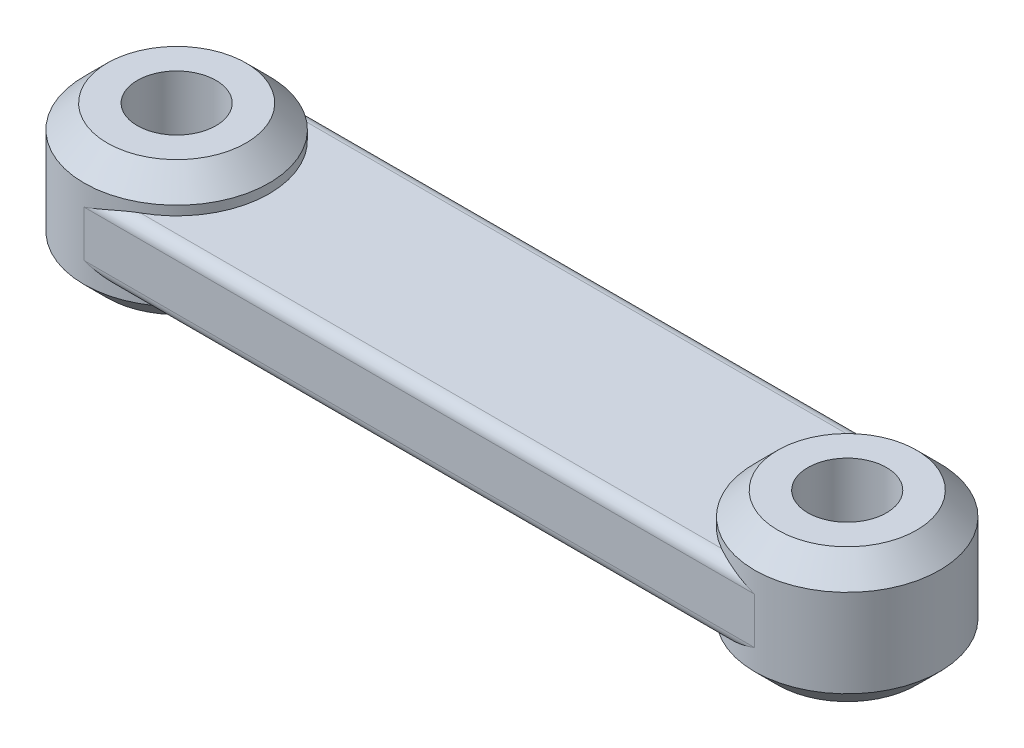
ISO-10303-21;
HEADER;
FILE_DESCRIPTION(('STEP AP214'),'2;1');
FILE_NAME('part.step','',(''),(''),'','','');
FILE_SCHEMA(('AUTOMOTIVE_DESIGN { 1 0 10303 214 1 1 1 1 }'));
ENDSEC;
DATA;
#1=APPLICATION_CONTEXT('core data for automotive mechanical design processes');
#2=APPLICATION_PROTOCOL_DEFINITION('international standard','automotive_design',2000,#1);
#3=PRODUCT_CONTEXT('',#1,'mechanical');
#4=PRODUCT('Part','Part','',(#3));
#5=PRODUCT_RELATED_PRODUCT_CATEGORY('part','',(#4));
#6=PRODUCT_DEFINITION_FORMATION('','',#4);
#7=PRODUCT_DEFINITION_CONTEXT('part definition',#1,'design');
#8=PRODUCT_DEFINITION('design','',#6,#7);
#9=PRODUCT_DEFINITION_SHAPE('','',#8);
#10=(LENGTH_UNIT() NAMED_UNIT(*) SI_UNIT(.MILLI.,.METRE.));
#11=(NAMED_UNIT(*) PLANE_ANGLE_UNIT() SI_UNIT($,.RADIAN.));
#12=(NAMED_UNIT(*) SI_UNIT($,.STERADIAN.) SOLID_ANGLE_UNIT());
#13=UNCERTAINTY_MEASURE_WITH_UNIT(LENGTH_MEASURE(1.E-05),#10,'distance_accuracy_value','');
#14=(GEOMETRIC_REPRESENTATION_CONTEXT(3) GLOBAL_UNCERTAINTY_ASSIGNED_CONTEXT((#13)) GLOBAL_UNIT_ASSIGNED_CONTEXT((#10,
#11,#12)) REPRESENTATION_CONTEXT('',''));
#15=CARTESIAN_POINT('',(0.,0.,0.));
#16=DIRECTION('',(0.,0.,1.));
#17=DIRECTION('',(1.,0.,0.));
#18=AXIS2_PLACEMENT_3D('',#15,#16,#17);
#19=CARTESIAN_POINT('',(-14.5,1.5,0.));
#20=DIRECTION('',(0.,-1.,0.));
#21=DIRECTION('',(0.,0.,-1.));
#22=AXIS2_PLACEMENT_3D('',#19,#20,#21);
#23=PLANE('',#22);
#24=CARTESIAN_POINT('',(14.5,1.5,0.));
#25=DIRECTION('',(0.,-1.,0.));
#26=DIRECTION('',(0.,0.,-1.));
#27=AXIS2_PLACEMENT_3D('',#24,#25,#26);
#28=CIRCLE('',#27,4.);
#29=CARTESIAN_POINT('',(12.5635083268963,1.5,-3.5));
#30=VERTEX_POINT('',#29);
#31=CARTESIAN_POINT('',(12.5635083268963,1.5,3.5));
#32=VERTEX_POINT('',#31);
#33=EDGE_CURVE('E109',#30,#32,#28,.F.);
#34=ORIENTED_EDGE('',*,*,#33,.F.);
#35=DIRECTION('',(-1.,0.,0.));
#36=VECTOR('',#35,1.);
#37=CARTESIAN_POINT('',(-14.5,1.5,-3.5));
#38=LINE('',#37,#36);
#39=CARTESIAN_POINT('',(-12.5635083268963,1.5,-3.5));
#40=VERTEX_POINT('',#39);
#41=EDGE_CURVE('E128',#30,#40,#38,.T.);
#42=ORIENTED_EDGE('',*,*,#41,.T.);
#43=CARTESIAN_POINT('',(-14.5,1.5,0.));
#44=DIRECTION('',(0.,-1.,0.));
#45=DIRECTION('',(0.,0.,-1.));
#46=AXIS2_PLACEMENT_3D('',#43,#44,#45);
#47=CIRCLE('',#46,4.);
#48=CARTESIAN_POINT('',(-12.5635083268963,1.5,3.5));
#49=VERTEX_POINT('',#48);
#50=EDGE_CURVE('E92',#40,#49,#47,.T.);
#51=ORIENTED_EDGE('',*,*,#50,.T.);
#52=DIRECTION('',(1.,0.,0.));
#53=VECTOR('',#52,1.);
#54=CARTESIAN_POINT('',(-14.5,1.5,3.5));
#55=LINE('',#54,#53);
#56=EDGE_CURVE('E125',#49,#32,#55,.T.);
#57=ORIENTED_EDGE('',*,*,#56,.T.);
#58=EDGE_LOOP('',(#34,#42,#51,#57));
#59=FACE_BOUND('',#58,.T.);
#60=ADVANCED_FACE('F16',(#59),#23,.F.);
#61=CARTESIAN_POINT('',(-14.5,-1.5,0.));
#62=DIRECTION('',(0.,-1.,0.));
#63=DIRECTION('',(0.,0.,-1.));
#64=AXIS2_PLACEMENT_3D('',#61,#62,#63);
#65=PLANE('',#64);
#66=CARTESIAN_POINT('',(-14.5,-1.5,0.));
#67=DIRECTION('',(0.,-1.,0.));
#68=DIRECTION('',(0.,0.,-1.));
#69=AXIS2_PLACEMENT_3D('',#66,#67,#68);
#70=CIRCLE('',#69,4.);
#71=CARTESIAN_POINT('',(-12.5635083268963,-1.5,-3.5));
#72=VERTEX_POINT('',#71);
#73=CARTESIAN_POINT('',(-12.5635083268963,-1.5,3.5));
#74=VERTEX_POINT('',#73);
#75=EDGE_CURVE('E251',#72,#74,#70,.T.);
#76=ORIENTED_EDGE('',*,*,#75,.F.);
#77=DIRECTION('',(-1.,0.,0.));
#78=VECTOR('',#77,1.);
#79=CARTESIAN_POINT('',(14.5,-1.5,-3.5));
#80=LINE('',#79,#78);
#81=CARTESIAN_POINT('',(12.5635083268963,-1.5,-3.5));
#82=VERTEX_POINT('',#81);
#83=EDGE_CURVE('E123',#72,#82,#80,.F.);
#84=ORIENTED_EDGE('',*,*,#83,.T.);
#85=CARTESIAN_POINT('',(14.5,-1.5,0.));
#86=DIRECTION('',(0.,-1.,0.));
#87=DIRECTION('',(0.,0.,-1.));
#88=AXIS2_PLACEMENT_3D('',#85,#86,#87);
#89=CIRCLE('',#88,4.);
#90=CARTESIAN_POINT('',(12.5635083268963,-1.5,3.5));
#91=VERTEX_POINT('',#90);
#92=EDGE_CURVE('E270',#82,#91,#89,.F.);
#93=ORIENTED_EDGE('',*,*,#92,.T.);
#94=DIRECTION('',(1.,0.,0.));
#95=VECTOR('',#94,1.);
#96=CARTESIAN_POINT('',(-14.5,-1.5,3.5));
#97=LINE('',#96,#95);
#98=EDGE_CURVE('E115',#91,#74,#97,.F.);
#99=ORIENTED_EDGE('',*,*,#98,.T.);
#100=EDGE_LOOP('',(#76,#84,#93,#99));
#101=FACE_BOUND('',#100,.T.);
#102=ADVANCED_FACE('F155',(#101),#65,.T.);
#103=CARTESIAN_POINT('',(-14.5,1.5,0.));
#104=DIRECTION('',(0.,-1.,0.));
#105=DIRECTION('',(0.,0.,-1.));
#106=AXIS2_PLACEMENT_3D('',#103,#104,#105);
#107=CYLINDRICAL_SURFACE('',#106,4.);
#108=CARTESIAN_POINT('',(-14.5,-1.9,0.));
#109=DIRECTION('',(0.,1.,0.));
#110=DIRECTION('',(0.,0.,1.));
#111=AXIS2_PLACEMENT_3D('',#108,#109,#110);
#112=CIRCLE('',#111,4.);
#113=CARTESIAN_POINT('',(-14.5,-1.9,4.));
#114=VERTEX_POINT('',#113);
#115=EDGE_CURVE('E118',#114,#114,#112,.T.);
#116=ORIENTED_EDGE('',*,*,#115,.T.);
#117=EDGE_LOOP('',(#116));
#118=FACE_BOUND('',#117,.T.);
#119=CARTESIAN_POINT('',(-14.5,1.9,0.));
#120=DIRECTION('',(0.,1.,0.));
#121=DIRECTION('',(0.,0.,1.));
#122=AXIS2_PLACEMENT_3D('',#119,#120,#121);
#123=CIRCLE('',#122,4.);
#124=CARTESIAN_POINT('',(-14.5,1.9,4.));
#125=VERTEX_POINT('',#124);
#126=EDGE_CURVE('E288',#125,#125,#123,.F.);
#127=ORIENTED_EDGE('',*,*,#126,.T.);
#128=EDGE_LOOP('',(#127));
#129=FACE_BOUND('',#128,.T.);
#130=ORIENTED_EDGE('',*,*,#50,.F.);
#131=CARTESIAN_POINT('',(-12.5635083268963,1.5,-3.5));
#132=CARTESIAN_POINT('',(-12.5924697196518,1.4999954757678,-3.51602452890695));
#133=CARTESIAN_POINT('',(-12.6216210442841,1.4992302686469,-3.5316832268583));
#134=CARTESIAN_POINT('',(-12.6802385646572,1.49634910161056,-3.56224076830084));
#135=CARTESIAN_POINT('',(-12.7097046187069,1.49423372626266,-3.57713993762363));
#136=CARTESIAN_POINT('',(-12.7983811729922,1.48612920392454,-3.62061046682219));
#137=CARTESIAN_POINT('',(-12.858001728702,1.47838008637467,-3.64802762012));
#138=CARTESIAN_POINT('',(-12.9777181802511,1.45926017201539,-3.69957957997044));
#139=CARTESIAN_POINT('',(-13.0378106824255,1.44790600183876,-3.72372874338325));
#140=CARTESIAN_POINT('',(-13.1585869713468,1.42232116870399,-3.76892191495083));
#141=CARTESIAN_POINT('',(-13.2192711612529,1.40808839180839,-3.78996362134686));
#142=CARTESIAN_POINT('',(-13.3795210187192,1.36765833193903,-3.84127671374755));
#143=CARTESIAN_POINT('',(-13.4794426619068,1.33958095357195,-3.8689866165185));
#144=CARTESIAN_POINT('',(-13.6799418756867,1.27943355705003,-3.91639293315178));
#145=CARTESIAN_POINT('',(-13.7805197001398,1.24736189468102,-3.93608603262952));
#146=CARTESIAN_POINT('',(-14.0830245921081,1.14739772022135,-3.9834384859329));
#147=CARTESIAN_POINT('',(-14.2857494414137,1.07574853983582,-3.99937929482846));
#148=CARTESIAN_POINT('',(-14.4920496873755,1.00281083607507,-3.99999406881035));
#149=CARTESIAN_POINT('',(-14.4960249264523,1.00140537601296,-3.99999999403084));
#150=CARTESIAN_POINT('',(-14.5,1.,-4.));
#151=B_SPLINE_CURVE_WITH_KNOTS('',3,(#131,#132,#133,#134,#135,#136,#137,#138,#139,#140,#141,
#142,#143,#144,#145,#146,#147,#148,#149,#150),.UNSPECIFIED.,.F.,.F.,(4,2,2,2,2,2,2,2,2,4),(0.,
0.0992685761729092,0.19849420224442,0.396495797958403,0.593597153212495,0.790843781091398,
1.11263751267447,1.43456414856119,2.07833236296141,2.09098148611784),.UNSPECIFIED.);
#152=CARTESIAN_POINT('',(-14.5,1.,-4.));
#153=VERTEX_POINT('',#152);
#154=EDGE_CURVE('E87',#40,#153,#151,.T.);
#155=ORIENTED_EDGE('',*,*,#154,.T.);
#156=DIRECTION('',(0.,-1.,0.));
#157=VECTOR('',#156,1.);
#158=CARTESIAN_POINT('',(-14.5,1.5,-4.));
#159=LINE('',#158,#157);
#160=CARTESIAN_POINT('',(-14.5,-1.,-4.));
#161=VERTEX_POINT('',#160);
#162=EDGE_CURVE('E90',#153,#161,#159,.T.);
#163=ORIENTED_EDGE('',*,*,#162,.T.);
#164=CARTESIAN_POINT('',(-12.5635083268963,-1.5,-3.5));
#165=CARTESIAN_POINT('',(-12.5924697196518,-1.4999954757678,-3.51602452890695));
#166=CARTESIAN_POINT('',(-12.6216210442841,-1.4992302686469,-3.5316832268583));
#167=CARTESIAN_POINT('',(-12.6802385646572,-1.49634910161056,-3.56224076830084));
#168=CARTESIAN_POINT('',(-12.7097046187069,-1.49423372626266,-3.57713993762363));
#169=CARTESIAN_POINT('',(-12.7983811729922,-1.48612920392454,-3.62061046682219));
#170=CARTESIAN_POINT('',(-12.858001728702,-1.47838008637467,-3.64802762012));
#171=CARTESIAN_POINT('',(-12.9777181802511,-1.45926017201539,-3.69957957997044));
#172=CARTESIAN_POINT('',(-13.0378106824255,-1.44790600183876,-3.72372874338325));
#173=CARTESIAN_POINT('',(-13.1585869713468,-1.42232116870399,-3.76892191495083));
#174=CARTESIAN_POINT('',(-13.2192711612529,-1.40808839180839,-3.78996362134686));
#175=CARTESIAN_POINT('',(-13.3795210187192,-1.36765833193903,-3.84127671374755));
#176=CARTESIAN_POINT('',(-13.4794426619068,-1.33958095357195,-3.8689866165185));
#177=CARTESIAN_POINT('',(-13.6799418756867,-1.27943355705003,-3.91639293315178));
#178=CARTESIAN_POINT('',(-13.7805197001398,-1.24736189468102,-3.93608603262952));
#179=CARTESIAN_POINT('',(-14.0830245921081,-1.14739772022135,-3.9834384859329));
#180=CARTESIAN_POINT('',(-14.2857494414137,-1.07574853983582,-3.99937929482846));
#181=CARTESIAN_POINT('',(-14.4920496873755,-1.00281083607507,-3.99999406881035));
#182=CARTESIAN_POINT('',(-14.4960249264523,-1.00140537601296,-3.99999999403084));
#183=CARTESIAN_POINT('',(-14.5,-1.,-4.));
#184=B_SPLINE_CURVE_WITH_KNOTS('',3,(#164,#165,#166,#167,#168,#169,#170,#171,#172,#173,#174,
#175,#176,#177,#178,#179,#180,#181,#182,#183),.UNSPECIFIED.,.F.,.F.,(4,2,2,2,2,2,2,2,2,4),(0.,
0.0992685761729092,0.19849420224442,0.396495797958403,0.593597153212495,0.790843781091398,
1.11263751267447,1.43456414856119,2.07833236296141,2.09098148611784),.UNSPECIFIED.);
#185=EDGE_CURVE('E134',#161,#72,#184,.F.);
#186=ORIENTED_EDGE('',*,*,#185,.T.);
#187=ORIENTED_EDGE('',*,*,#75,.T.);
#188=CARTESIAN_POINT('',(-12.5635083268963,-1.5,3.5));
#189=CARTESIAN_POINT('',(-12.5924697196518,-1.4999954757678,3.51602452890695));
#190=CARTESIAN_POINT('',(-12.6216210442841,-1.4992302686469,3.5316832268583));
#191=CARTESIAN_POINT('',(-12.6802385646572,-1.49634910161056,3.56224076830084));
#192=CARTESIAN_POINT('',(-12.7097046187069,-1.49423372626266,3.57713993762363));
#193=CARTESIAN_POINT('',(-12.7983811729922,-1.48612920392454,3.62061046682219));
#194=CARTESIAN_POINT('',(-12.858001728702,-1.47838008637467,3.64802762012));
#195=CARTESIAN_POINT('',(-12.9777181802511,-1.45926017201539,3.69957957997044));
#196=CARTESIAN_POINT('',(-13.0378106824255,-1.44790600183876,3.72372874338325));
#197=CARTESIAN_POINT('',(-13.1585869713468,-1.42232116870399,3.76892191495083));
#198=CARTESIAN_POINT('',(-13.2192711612529,-1.40808839180839,3.78996362134686));
#199=CARTESIAN_POINT('',(-13.3795210187192,-1.36765833193903,3.84127671374755));
#200=CARTESIAN_POINT('',(-13.4794426619068,-1.33958095357195,3.8689866165185));
#201=CARTESIAN_POINT('',(-13.6799418756867,-1.27943355705003,3.91639293315178));
#202=CARTESIAN_POINT('',(-13.7805197001398,-1.24736189468102,3.93608603262952));
#203=CARTESIAN_POINT('',(-14.0830245921081,-1.14739772022135,3.9834384859329));
#204=CARTESIAN_POINT('',(-14.2857494414137,-1.07574853983582,3.99937929482846));
#205=CARTESIAN_POINT('',(-14.4920496873755,-1.00281083607507,3.99999406881035));
#206=CARTESIAN_POINT('',(-14.4960249264523,-1.00140537601296,3.99999999403084));
#207=CARTESIAN_POINT('',(-14.5,-1.,4.));
#208=B_SPLINE_CURVE_WITH_KNOTS('',3,(#188,#189,#190,#191,#192,#193,#194,#195,#196,#197,#198,
#199,#200,#201,#202,#203,#204,#205,#206,#207),.UNSPECIFIED.,.F.,.F.,(4,2,2,2,2,2,2,2,2,4),(0.,
0.0992685761729092,0.19849420224442,0.396495797958403,0.593597153212495,0.790843781091398,
1.11263751267447,1.43456414856119,2.07833236296141,2.09098148611784),.UNSPECIFIED.);
#209=CARTESIAN_POINT('',(-14.5,-1.,4.));
#210=VERTEX_POINT('',#209);
#211=EDGE_CURVE('E37',#74,#210,#208,.T.);
#212=ORIENTED_EDGE('',*,*,#211,.T.);
#213=DIRECTION('',(0.,-1.,0.));
#214=VECTOR('',#213,1.);
#215=CARTESIAN_POINT('',(-14.5,1.5,4.));
#216=LINE('',#215,#214);
#217=CARTESIAN_POINT('',(-14.5,1.,4.));
#218=VERTEX_POINT('',#217);
#219=EDGE_CURVE('E268',#218,#210,#216,.T.);
#220=ORIENTED_EDGE('',*,*,#219,.F.);
#221=CARTESIAN_POINT('',(-12.5635083268963,1.5,3.5));
#222=CARTESIAN_POINT('',(-12.5924697196518,1.4999954757678,3.51602452890695));
#223=CARTESIAN_POINT('',(-12.6216210442841,1.4992302686469,3.5316832268583));
#224=CARTESIAN_POINT('',(-12.6802385646572,1.49634910161056,3.56224076830084));
#225=CARTESIAN_POINT('',(-12.7097046187069,1.49423372626266,3.57713993762363));
#226=CARTESIAN_POINT('',(-12.7983811729922,1.48612920392454,3.62061046682219));
#227=CARTESIAN_POINT('',(-12.858001728702,1.47838008637467,3.64802762012));
#228=CARTESIAN_POINT('',(-12.9777181802511,1.45926017201539,3.69957957997044));
#229=CARTESIAN_POINT('',(-13.0378106824255,1.44790600183876,3.72372874338325));
#230=CARTESIAN_POINT('',(-13.1585869713468,1.42232116870399,3.76892191495083));
#231=CARTESIAN_POINT('',(-13.2192711612529,1.40808839180839,3.78996362134686));
#232=CARTESIAN_POINT('',(-13.3795210187192,1.36765833193903,3.84127671374755));
#233=CARTESIAN_POINT('',(-13.4794426619068,1.33958095357195,3.8689866165185));
#234=CARTESIAN_POINT('',(-13.6799418756867,1.27943355705003,3.91639293315178));
#235=CARTESIAN_POINT('',(-13.7805197001398,1.24736189468102,3.93608603262952));
#236=CARTESIAN_POINT('',(-14.0830245921081,1.14739772022135,3.9834384859329));
#237=CARTESIAN_POINT('',(-14.2857494414137,1.07574853983582,3.99937929482846));
#238=CARTESIAN_POINT('',(-14.4920496873755,1.00281083607507,3.99999406881035));
#239=CARTESIAN_POINT('',(-14.4960249264523,1.00140537601296,3.99999999403084));
#240=CARTESIAN_POINT('',(-14.5,1.,4.));
#241=B_SPLINE_CURVE_WITH_KNOTS('',3,(#221,#222,#223,#224,#225,#226,#227,#228,#229,#230,#231,
#232,#233,#234,#235,#236,#237,#238,#239,#240),.UNSPECIFIED.,.F.,.F.,(4,2,2,2,2,2,2,2,2,4),(0.,
0.0992685761729092,0.19849420224442,0.396495797958403,0.593597153212495,0.790843781091398,
1.11263751267447,1.43456414856119,2.07833236296141,2.09098148611784),.UNSPECIFIED.);
#242=EDGE_CURVE('E11',#218,#49,#241,.F.);
#243=ORIENTED_EDGE('',*,*,#242,.T.);
#244=EDGE_LOOP('',(#130,#155,#163,#186,#187,#212,#220,#243));
#245=FACE_BOUND('',#244,.T.);
#246=ADVANCED_FACE('F89',(#118,#129,#245),#107,.T.);
#247=CARTESIAN_POINT('',(-14.5,1.5,4.));
#248=DIRECTION('',(0.,0.,-1.));
#249=DIRECTION('',(-1.,0.,0.));
#250=AXIS2_PLACEMENT_3D('',#247,#248,#249);
#251=PLANE('',#250);
#252=ORIENTED_EDGE('',*,*,#219,.T.);
#253=DIRECTION('',(1.,0.,0.));
#254=VECTOR('',#253,1.);
#255=CARTESIAN_POINT('',(14.5,-1.,4.));
#256=LINE('',#255,#254);
#257=CARTESIAN_POINT('',(14.5,-1.,4.));
#258=VERTEX_POINT('',#257);
#259=EDGE_CURVE('E131',#210,#258,#256,.T.);
#260=ORIENTED_EDGE('',*,*,#259,.T.);
#261=DIRECTION('',(0.,-1.,0.));
#262=VECTOR('',#261,1.);
#263=CARTESIAN_POINT('',(14.5,1.5,4.));
#264=LINE('',#263,#262);
#265=CARTESIAN_POINT('',(14.5,1.,4.));
#266=VERTEX_POINT('',#265);
#267=EDGE_CURVE('E265',#266,#258,#264,.T.);
#268=ORIENTED_EDGE('',*,*,#267,.F.);
#269=DIRECTION('',(1.,0.,0.));
#270=VECTOR('',#269,1.);
#271=CARTESIAN_POINT('',(-14.5,1.,4.));
#272=LINE('',#271,#270);
#273=EDGE_CURVE('E44',#266,#218,#272,.F.);
#274=ORIENTED_EDGE('',*,*,#273,.T.);
#275=EDGE_LOOP('',(#252,#260,#268,#274));
#276=FACE_BOUND('',#275,.T.);
#277=ADVANCED_FACE('F154',(#276),#251,.F.);
#278=CARTESIAN_POINT('',(14.5,1.5,0.));
#279=DIRECTION('',(0.,-1.,0.));
#280=DIRECTION('',(0.,0.,-1.));
#281=AXIS2_PLACEMENT_3D('',#278,#279,#280);
#282=CYLINDRICAL_SURFACE('',#281,4.);
#283=CARTESIAN_POINT('',(14.5,-1.9,0.));
#284=DIRECTION('',(0.,1.,0.));
#285=DIRECTION('',(0.,0.,1.));
#286=AXIS2_PLACEMENT_3D('',#283,#284,#285);
#287=CIRCLE('',#286,4.);
#288=CARTESIAN_POINT('',(14.5,-1.9,4.));
#289=VERTEX_POINT('',#288);
#290=EDGE_CURVE('E276',#289,#289,#287,.T.);
#291=ORIENTED_EDGE('',*,*,#290,.T.);
#292=EDGE_LOOP('',(#291));
#293=FACE_BOUND('',#292,.T.);
#294=CARTESIAN_POINT('',(14.5,1.9,0.));
#295=DIRECTION('',(0.,1.,0.));
#296=DIRECTION('',(0.,0.,1.));
#297=AXIS2_PLACEMENT_3D('',#294,#295,#296);
#298=CIRCLE('',#297,4.);
#299=CARTESIAN_POINT('',(14.5,1.9,4.));
#300=VERTEX_POINT('',#299);
#301=EDGE_CURVE('E273',#300,#300,#298,.F.);
#302=ORIENTED_EDGE('',*,*,#301,.T.);
#303=EDGE_LOOP('',(#302));
#304=FACE_BOUND('',#303,.T.);
#305=ORIENTED_EDGE('',*,*,#33,.T.);
#306=CARTESIAN_POINT('',(12.5635083268963,1.5,3.5));
#307=CARTESIAN_POINT('',(12.5924697196518,1.4999954757678,3.51602452890695));
#308=CARTESIAN_POINT('',(12.6216210442841,1.4992302686469,3.5316832268583));
#309=CARTESIAN_POINT('',(12.6802385646572,1.49634910161056,3.56224076830084));
#310=CARTESIAN_POINT('',(12.7097046187069,1.49423372626266,3.57713993762363));
#311=CARTESIAN_POINT('',(12.7983811729922,1.48612920392454,3.62061046682219));
#312=CARTESIAN_POINT('',(12.858001728702,1.47838008637467,3.64802762012));
#313=CARTESIAN_POINT('',(12.9777181802511,1.45926017201539,3.69957957997044));
#314=CARTESIAN_POINT('',(13.0378106824255,1.44790600183876,3.72372874338325));
#315=CARTESIAN_POINT('',(13.1585869713468,1.42232116870399,3.76892191495083));
#316=CARTESIAN_POINT('',(13.2192711612529,1.40808839180839,3.78996362134686));
#317=CARTESIAN_POINT('',(13.3795210187192,1.36765833193903,3.84127671374755));
#318=CARTESIAN_POINT('',(13.4794426619068,1.33958095357195,3.8689866165185));
#319=CARTESIAN_POINT('',(13.6799418756867,1.27943355705003,3.91639293315178));
#320=CARTESIAN_POINT('',(13.7805197001398,1.24736189468102,3.93608603262952));
#321=CARTESIAN_POINT('',(14.0830245921081,1.14739772022135,3.9834384859329));
#322=CARTESIAN_POINT('',(14.2857494414137,1.07574853983582,3.99937929482846));
#323=CARTESIAN_POINT('',(14.4920496873755,1.00281083607507,3.99999406881035));
#324=CARTESIAN_POINT('',(14.4960249264523,1.00140537601296,3.99999999403084));
#325=CARTESIAN_POINT('',(14.5,1.,4.));
#326=B_SPLINE_CURVE_WITH_KNOTS('',3,(#306,#307,#308,#309,#310,#311,#312,#313,#314,#315,#316,
#317,#318,#319,#320,#321,#322,#323,#324,#325),.UNSPECIFIED.,.F.,.F.,(4,2,2,2,2,2,2,2,2,4),(0.,
0.0992685761729092,0.19849420224442,0.396495797958403,0.593597153212495,0.790843781091398,
1.11263751267447,1.43456414856119,2.07833236296141,2.09098148611784),.UNSPECIFIED.);
#327=EDGE_CURVE('E30',#32,#266,#326,.T.);
#328=ORIENTED_EDGE('',*,*,#327,.T.);
#329=ORIENTED_EDGE('',*,*,#267,.T.);
#330=CARTESIAN_POINT('',(12.5635083268963,-1.5,3.5));
#331=CARTESIAN_POINT('',(12.5924697196518,-1.4999954757678,3.51602452890695));
#332=CARTESIAN_POINT('',(12.6216210442841,-1.4992302686469,3.5316832268583));
#333=CARTESIAN_POINT('',(12.6802385646572,-1.49634910161056,3.56224076830084));
#334=CARTESIAN_POINT('',(12.7097046187069,-1.49423372626266,3.57713993762363));
#335=CARTESIAN_POINT('',(12.7983811729922,-1.48612920392454,3.62061046682219));
#336=CARTESIAN_POINT('',(12.858001728702,-1.47838008637467,3.64802762012));
#337=CARTESIAN_POINT('',(12.9777181802511,-1.45926017201539,3.69957957997044));
#338=CARTESIAN_POINT('',(13.0378106824255,-1.44790600183876,3.72372874338325));
#339=CARTESIAN_POINT('',(13.1585869713468,-1.42232116870399,3.76892191495083));
#340=CARTESIAN_POINT('',(13.2192711612529,-1.40808839180839,3.78996362134686));
#341=CARTESIAN_POINT('',(13.3795210187192,-1.36765833193903,3.84127671374755));
#342=CARTESIAN_POINT('',(13.4794426619068,-1.33958095357195,3.8689866165185));
#343=CARTESIAN_POINT('',(13.6799418756867,-1.27943355705003,3.91639293315178));
#344=CARTESIAN_POINT('',(13.7805197001398,-1.24736189468102,3.93608603262952));
#345=CARTESIAN_POINT('',(14.0830245921081,-1.14739772022135,3.9834384859329));
#346=CARTESIAN_POINT('',(14.2857494414137,-1.07574853983582,3.99937929482846));
#347=CARTESIAN_POINT('',(14.4920496873755,-1.00281083607507,3.99999406881035));
#348=CARTESIAN_POINT('',(14.4960249264523,-1.00140537601296,3.99999999403084));
#349=CARTESIAN_POINT('',(14.5,-1.,4.));
#350=B_SPLINE_CURVE_WITH_KNOTS('',3,(#330,#331,#332,#333,#334,#335,#336,#337,#338,#339,#340,
#341,#342,#343,#344,#345,#346,#347,#348,#349),.UNSPECIFIED.,.F.,.F.,(4,2,2,2,2,2,2,2,2,4),(0.,
0.0992685761729092,0.19849420224442,0.396495797958403,0.593597153212495,0.790843781091398,
1.11263751267447,1.43456414856119,2.07833236296141,2.09098148611784),.UNSPECIFIED.);
#351=EDGE_CURVE('E173',#258,#91,#350,.F.);
#352=ORIENTED_EDGE('',*,*,#351,.T.);
#353=ORIENTED_EDGE('',*,*,#92,.F.);
#354=CARTESIAN_POINT('',(12.5635083268963,-1.5,-3.5));
#355=CARTESIAN_POINT('',(12.5924697196518,-1.4999954757678,-3.51602452890695));
#356=CARTESIAN_POINT('',(12.6216210442841,-1.4992302686469,-3.5316832268583));
#357=CARTESIAN_POINT('',(12.6802385646572,-1.49634910161056,-3.56224076830084));
#358=CARTESIAN_POINT('',(12.7097046187069,-1.49423372626266,-3.57713993762363));
#359=CARTESIAN_POINT('',(12.7983811729922,-1.48612920392454,-3.62061046682219));
#360=CARTESIAN_POINT('',(12.858001728702,-1.47838008637467,-3.64802762012));
#361=CARTESIAN_POINT('',(12.9777181802511,-1.45926017201539,-3.69957957997044));
#362=CARTESIAN_POINT('',(13.0378106824255,-1.44790600183876,-3.72372874338325));
#363=CARTESIAN_POINT('',(13.1585869713468,-1.42232116870399,-3.76892191495083));
#364=CARTESIAN_POINT('',(13.2192711612529,-1.40808839180839,-3.78996362134686));
#365=CARTESIAN_POINT('',(13.3795210187192,-1.36765833193903,-3.84127671374755));
#366=CARTESIAN_POINT('',(13.4794426619068,-1.33958095357195,-3.8689866165185));
#367=CARTESIAN_POINT('',(13.6799418756867,-1.27943355705003,-3.91639293315178));
#368=CARTESIAN_POINT('',(13.7805197001398,-1.24736189468102,-3.93608603262952));
#369=CARTESIAN_POINT('',(14.0830245921081,-1.14739772022135,-3.9834384859329));
#370=CARTESIAN_POINT('',(14.2857494414137,-1.07574853983582,-3.99937929482846));
#371=CARTESIAN_POINT('',(14.4920496873755,-1.00281083607507,-3.99999406881035));
#372=CARTESIAN_POINT('',(14.4960249264523,-1.00140537601296,-3.99999999403084));
#373=CARTESIAN_POINT('',(14.5,-1.,-4.));
#374=B_SPLINE_CURVE_WITH_KNOTS('',3,(#354,#355,#356,#357,#358,#359,#360,#361,#362,#363,#364,
#365,#366,#367,#368,#369,#370,#371,#372,#373),.UNSPECIFIED.,.F.,.F.,(4,2,2,2,2,2,2,2,2,4),(0.,
0.0992685761729092,0.19849420224442,0.396495797958403,0.593597153212495,0.790843781091398,
1.11263751267447,1.43456414856119,2.07833236296141,2.09098148611784),.UNSPECIFIED.);
#375=CARTESIAN_POINT('',(14.5,-1.,-4.));
#376=VERTEX_POINT('',#375);
#377=EDGE_CURVE('E98',#82,#376,#374,.T.);
#378=ORIENTED_EDGE('',*,*,#377,.T.);
#379=DIRECTION('',(0.,-1.,0.));
#380=VECTOR('',#379,1.);
#381=CARTESIAN_POINT('',(14.5,1.5,-4.));
#382=LINE('',#381,#380);
#383=CARTESIAN_POINT('',(14.5,1.,-4.));
#384=VERTEX_POINT('',#383);
#385=EDGE_CURVE('E108',#384,#376,#382,.T.);
#386=ORIENTED_EDGE('',*,*,#385,.F.);
#387=CARTESIAN_POINT('',(12.5635083268963,1.5,-3.5));
#388=CARTESIAN_POINT('',(12.5924697196518,1.4999954757678,-3.51602452890695));
#389=CARTESIAN_POINT('',(12.6216210442841,1.4992302686469,-3.5316832268583));
#390=CARTESIAN_POINT('',(12.6802385646572,1.49634910161056,-3.56224076830084));
#391=CARTESIAN_POINT('',(12.7097046187069,1.49423372626266,-3.57713993762363));
#392=CARTESIAN_POINT('',(12.7983811729922,1.48612920392454,-3.62061046682219));
#393=CARTESIAN_POINT('',(12.858001728702,1.47838008637467,-3.64802762012));
#394=CARTESIAN_POINT('',(12.9777181802511,1.45926017201539,-3.69957957997044));
#395=CARTESIAN_POINT('',(13.0378106824255,1.44790600183876,-3.72372874338325));
#396=CARTESIAN_POINT('',(13.1585869713468,1.42232116870399,-3.76892191495083));
#397=CARTESIAN_POINT('',(13.2192711612529,1.40808839180839,-3.78996362134686));
#398=CARTESIAN_POINT('',(13.3795210187192,1.36765833193903,-3.84127671374755));
#399=CARTESIAN_POINT('',(13.4794426619068,1.33958095357195,-3.8689866165185));
#400=CARTESIAN_POINT('',(13.6799418756867,1.27943355705003,-3.91639293315178));
#401=CARTESIAN_POINT('',(13.7805197001398,1.24736189468102,-3.93608603262952));
#402=CARTESIAN_POINT('',(14.0830245921081,1.14739772022135,-3.9834384859329));
#403=CARTESIAN_POINT('',(14.2857494414137,1.07574853983582,-3.99937929482846));
#404=CARTESIAN_POINT('',(14.4920496873755,1.00281083607507,-3.99999406881035));
#405=CARTESIAN_POINT('',(14.4960249264523,1.00140537601296,-3.99999999403084));
#406=CARTESIAN_POINT('',(14.5,1.,-4.));
#407=B_SPLINE_CURVE_WITH_KNOTS('',3,(#387,#388,#389,#390,#391,#392,#393,#394,#395,#396,#397,
#398,#399,#400,#401,#402,#403,#404,#405,#406),.UNSPECIFIED.,.F.,.F.,(4,2,2,2,2,2,2,2,2,4),(0.,
0.0992685761729092,0.19849420224442,0.396495797958403,0.593597153212495,0.790843781091398,
1.11263751267447,1.43456414856119,2.07833236296141,2.09098148611784),.UNSPECIFIED.);
#408=EDGE_CURVE('E97',#384,#30,#407,.F.);
#409=ORIENTED_EDGE('',*,*,#408,.T.);
#410=EDGE_LOOP('',(#305,#328,#329,#352,#353,#378,#386,#409));
#411=FACE_BOUND('',#410,.T.);
#412=ADVANCED_FACE('F194',(#293,#304,#411),#282,.T.);
#413=CARTESIAN_POINT('',(-14.5,1.5,-4.));
#414=DIRECTION('',(0.,0.,1.));
#415=DIRECTION('',(1.,0.,0.));
#416=AXIS2_PLACEMENT_3D('',#413,#414,#415);
#417=PLANE('',#416);
#418=ORIENTED_EDGE('',*,*,#385,.T.);
#419=DIRECTION('',(-1.,0.,0.));
#420=VECTOR('',#419,1.);
#421=CARTESIAN_POINT('',(-14.5,-1.,-4.));
#422=LINE('',#421,#420);
#423=EDGE_CURVE('E107',#376,#161,#422,.T.);
#424=ORIENTED_EDGE('',*,*,#423,.T.);
#425=ORIENTED_EDGE('',*,*,#162,.F.);
#426=DIRECTION('',(-1.,0.,0.));
#427=VECTOR('',#426,1.);
#428=CARTESIAN_POINT('',(-14.5,1.,-4.));
#429=LINE('',#428,#427);
#430=EDGE_CURVE('E104',#153,#384,#429,.F.);
#431=ORIENTED_EDGE('',*,*,#430,.T.);
#432=EDGE_LOOP('',(#418,#424,#425,#431));
#433=FACE_BOUND('',#432,.T.);
#434=ADVANCED_FACE('F103',(#433),#417,.F.);
#435=CARTESIAN_POINT('',(14.5,-2.9,0.));
#436=DIRECTION('',(0.,1.,0.));
#437=DIRECTION('',(0.,0.,1.));
#438=AXIS2_PLACEMENT_3D('',#435,#436,#437);
#439=PLANE('',#438);
#440=CARTESIAN_POINT('',(14.5,-2.9,0.));
#441=DIRECTION('',(0.,1.,0.));
#442=DIRECTION('',(0.,0.,1.));
#443=AXIS2_PLACEMENT_3D('',#440,#441,#442);
#444=CIRCLE('',#443,3.);
#445=CARTESIAN_POINT('',(14.5,-2.9,3.));
#446=VERTEX_POINT('',#445);
#447=EDGE_CURVE('E279',#446,#446,#444,.F.);
#448=ORIENTED_EDGE('',*,*,#447,.T.);
#449=EDGE_LOOP('',(#448));
#450=FACE_BOUND('',#449,.T.);
#451=CARTESIAN_POINT('',(14.5,-2.9,0.));
#452=DIRECTION('',(0.,1.,0.));
#453=DIRECTION('',(0.,0.,1.));
#454=AXIS2_PLACEMENT_3D('',#451,#452,#453);
#455=CIRCLE('',#454,1.7);
#456=CARTESIAN_POINT('',(14.5,-2.9,1.7));
#457=VERTEX_POINT('',#456);
#458=EDGE_CURVE('E259',#457,#457,#455,.T.);
#459=ORIENTED_EDGE('',*,*,#458,.T.);
#460=EDGE_LOOP('',(#459));
#461=FACE_BOUND('',#460,.T.);
#462=ADVANCED_FACE('F204',(#450,#461),#439,.F.);
#463=CARTESIAN_POINT('',(14.5,2.9,0.));
#464=DIRECTION('',(0.,1.,0.));
#465=DIRECTION('',(0.,0.,1.));
#466=AXIS2_PLACEMENT_3D('',#463,#464,#465);
#467=PLANE('',#466);
#468=CARTESIAN_POINT('',(14.5,2.9,0.));
#469=DIRECTION('',(0.,1.,0.));
#470=DIRECTION('',(0.,0.,1.));
#471=AXIS2_PLACEMENT_3D('',#468,#469,#470);
#472=CIRCLE('',#471,3.);
#473=CARTESIAN_POINT('',(14.5,2.9,3.));
#474=VERTEX_POINT('',#473);
#475=EDGE_CURVE('E282',#474,#474,#472,.T.);
#476=ORIENTED_EDGE('',*,*,#475,.T.);
#477=EDGE_LOOP('',(#476));
#478=FACE_BOUND('',#477,.T.);
#479=CARTESIAN_POINT('',(14.5,2.9,0.));
#480=DIRECTION('',(0.,1.,0.));
#481=DIRECTION('',(0.,0.,1.));
#482=AXIS2_PLACEMENT_3D('',#479,#480,#481);
#483=CIRCLE('',#482,1.7);
#484=CARTESIAN_POINT('',(14.5,2.9,1.7));
#485=VERTEX_POINT('',#484);
#486=EDGE_CURVE('E256',#485,#485,#483,.T.);
#487=ORIENTED_EDGE('',*,*,#486,.F.);
#488=EDGE_LOOP('',(#487));
#489=FACE_BOUND('',#488,.T.);
#490=ADVANCED_FACE('F213',(#478,#489),#467,.T.);
#491=CARTESIAN_POINT('',(14.5,2.9,0.));
#492=DIRECTION('',(0.,1.,0.));
#493=DIRECTION('',(0.,0.,1.));
#494=AXIS2_PLACEMENT_3D('',#491,#492,#493);
#495=CYLINDRICAL_SURFACE('',#494,1.7);
#496=ORIENTED_EDGE('',*,*,#458,.F.);
#497=EDGE_LOOP('',(#496));
#498=FACE_BOUND('',#497,.T.);
#499=ORIENTED_EDGE('',*,*,#486,.T.);
#500=EDGE_LOOP('',(#499));
#501=FACE_BOUND('',#500,.T.);
#502=ADVANCED_FACE('F217',(#498,#501),#495,.F.);
#503=CARTESIAN_POINT('',(14.5,-1.9,0.));
#504=DIRECTION('',(0.,1.,0.));
#505=DIRECTION('',(0.,0.,1.));
#506=AXIS2_PLACEMENT_3D('',#503,#504,#505);
#507=CONICAL_SURFACE('',#506,4.,0.785398163397452);
#508=ORIENTED_EDGE('',*,*,#447,.F.);
#509=EDGE_LOOP('',(#508));
#510=FACE_BOUND('',#509,.T.);
#511=ORIENTED_EDGE('',*,*,#290,.F.);
#512=EDGE_LOOP('',(#511));
#513=FACE_BOUND('',#512,.T.);
#514=ADVANCED_FACE('F157',(#510,#513),#507,.T.);
#515=CARTESIAN_POINT('',(14.5,2.9,0.));
#516=DIRECTION('',(0.,-1.,0.));
#517=DIRECTION('',(0.,0.,-1.));
#518=AXIS2_PLACEMENT_3D('',#515,#516,#517);
#519=CONICAL_SURFACE('',#518,3.,0.785398163397447);
#520=ORIENTED_EDGE('',*,*,#301,.F.);
#521=EDGE_LOOP('',(#520));
#522=FACE_BOUND('',#521,.T.);
#523=ORIENTED_EDGE('',*,*,#475,.F.);
#524=EDGE_LOOP('',(#523));
#525=FACE_BOUND('',#524,.T.);
#526=ADVANCED_FACE('F226',(#522,#525),#519,.T.);
#527=CARTESIAN_POINT('',(-14.5,-2.9,0.));
#528=DIRECTION('',(0.,1.,0.));
#529=DIRECTION('',(0.,0.,1.));
#530=AXIS2_PLACEMENT_3D('',#527,#528,#529);
#531=PLANE('',#530);
#532=CARTESIAN_POINT('',(-14.5,-2.9,0.));
#533=DIRECTION('',(0.,1.,0.));
#534=DIRECTION('',(0.,0.,1.));
#535=AXIS2_PLACEMENT_3D('',#532,#533,#534);
#536=CIRCLE('',#535,3.);
#537=CARTESIAN_POINT('',(-14.5,-2.9,3.));
#538=VERTEX_POINT('',#537);
#539=EDGE_CURVE('E285',#538,#538,#536,.F.);
#540=ORIENTED_EDGE('',*,*,#539,.T.);
#541=EDGE_LOOP('',(#540));
#542=FACE_BOUND('',#541,.T.);
#543=CARTESIAN_POINT('',(-14.5,-2.9,0.));
#544=DIRECTION('',(0.,1.,0.));
#545=DIRECTION('',(0.,0.,1.));
#546=AXIS2_PLACEMENT_3D('',#543,#544,#545);
#547=CIRCLE('',#546,1.7);
#548=CARTESIAN_POINT('',(-14.5,-2.9,1.7));
#549=VERTEX_POINT('',#548);
#550=EDGE_CURVE('E245',#549,#549,#547,.T.);
#551=ORIENTED_EDGE('',*,*,#550,.T.);
#552=EDGE_LOOP('',(#551));
#553=FACE_BOUND('',#552,.T.);
#554=ADVANCED_FACE('F222',(#542,#553),#531,.F.);
#555=CARTESIAN_POINT('',(-14.5,2.9,0.));
#556=DIRECTION('',(0.,1.,0.));
#557=DIRECTION('',(0.,0.,1.));
#558=AXIS2_PLACEMENT_3D('',#555,#556,#557);
#559=PLANE('',#558);
#560=CARTESIAN_POINT('',(-14.5,2.9,0.));
#561=DIRECTION('',(0.,1.,0.));
#562=DIRECTION('',(0.,0.,1.));
#563=AXIS2_PLACEMENT_3D('',#560,#561,#562);
#564=CIRCLE('',#563,3.);
#565=CARTESIAN_POINT('',(-14.5,2.9,3.));
#566=VERTEX_POINT('',#565);
#567=EDGE_CURVE('E113',#566,#566,#564,.T.);
#568=ORIENTED_EDGE('',*,*,#567,.T.);
#569=EDGE_LOOP('',(#568));
#570=FACE_BOUND('',#569,.T.);
#571=CARTESIAN_POINT('',(-14.5,2.9,0.));
#572=DIRECTION('',(0.,1.,0.));
#573=DIRECTION('',(0.,0.,1.));
#574=AXIS2_PLACEMENT_3D('',#571,#572,#573);
#575=CIRCLE('',#574,1.7);
#576=CARTESIAN_POINT('',(-14.5,2.9,1.7));
#577=VERTEX_POINT('',#576);
#578=EDGE_CURVE('E248',#577,#577,#575,.T.);
#579=ORIENTED_EDGE('',*,*,#578,.F.);
#580=EDGE_LOOP('',(#579));
#581=FACE_BOUND('',#580,.T.);
#582=ADVANCED_FACE('F225',(#570,#581),#559,.T.);
#583=CARTESIAN_POINT('',(-14.5,2.9,0.));
#584=DIRECTION('',(0.,1.,0.));
#585=DIRECTION('',(0.,0.,1.));
#586=AXIS2_PLACEMENT_3D('',#583,#584,#585);
#587=CYLINDRICAL_SURFACE('',#586,1.7);
#588=ORIENTED_EDGE('',*,*,#550,.F.);
#589=EDGE_LOOP('',(#588));
#590=FACE_BOUND('',#589,.T.);
#591=ORIENTED_EDGE('',*,*,#578,.T.);
#592=EDGE_LOOP('',(#591));
#593=FACE_BOUND('',#592,.T.);
#594=ADVANCED_FACE('F230',(#590,#593),#587,.F.);
#595=CARTESIAN_POINT('',(-14.5,-2.9,0.));
#596=DIRECTION('',(0.,1.,0.));
#597=DIRECTION('',(0.,0.,1.));
#598=AXIS2_PLACEMENT_3D('',#595,#596,#597);
#599=CONICAL_SURFACE('',#598,3.,0.785398163397453);
#600=ORIENTED_EDGE('',*,*,#115,.F.);
#601=EDGE_LOOP('',(#600));
#602=FACE_BOUND('',#601,.T.);
#603=ORIENTED_EDGE('',*,*,#539,.F.);
#604=EDGE_LOOP('',(#603));
#605=FACE_BOUND('',#604,.T.);
#606=ADVANCED_FACE('F233',(#602,#605),#599,.T.);
#607=CARTESIAN_POINT('',(-14.5,1.9,0.));
#608=DIRECTION('',(0.,-1.,0.));
#609=DIRECTION('',(0.,0.,-1.));
#610=AXIS2_PLACEMENT_3D('',#607,#608,#609);
#611=CONICAL_SURFACE('',#610,4.,0.785398163397443);
#612=ORIENTED_EDGE('',*,*,#567,.F.);
#613=EDGE_LOOP('',(#612));
#614=FACE_BOUND('',#613,.T.);
#615=ORIENTED_EDGE('',*,*,#126,.F.);
#616=EDGE_LOOP('',(#615));
#617=FACE_BOUND('',#616,.T.);
#618=ADVANCED_FACE('F239',(#614,#617),#611,.T.);
#619=CARTESIAN_POINT('',(-14.5,-1.,-3.5));
#620=DIRECTION('',(1.,0.,0.));
#621=DIRECTION('',(0.,0.,-1.));
#622=AXIS2_PLACEMENT_3D('',#619,#620,#621);
#623=CYLINDRICAL_SURFACE('',#622,0.5);
#624=ORIENTED_EDGE('',*,*,#377,.F.);
#625=ORIENTED_EDGE('',*,*,#83,.F.);
#626=ORIENTED_EDGE('',*,*,#185,.F.);
#627=ORIENTED_EDGE('',*,*,#423,.F.);
#628=EDGE_LOOP('',(#624,#625,#626,#627));
#629=FACE_BOUND('',#628,.T.);
#630=ADVANCED_FACE('F146',(#629),#623,.T.);
#631=CARTESIAN_POINT('',(-14.5,1.,-3.5));
#632=DIRECTION('',(-1.,0.,0.));
#633=DIRECTION('',(0.,0.,1.));
#634=AXIS2_PLACEMENT_3D('',#631,#632,#633);
#635=CYLINDRICAL_SURFACE('',#634,0.5);
#636=ORIENTED_EDGE('',*,*,#408,.F.);
#637=ORIENTED_EDGE('',*,*,#430,.F.);
#638=ORIENTED_EDGE('',*,*,#154,.F.);
#639=ORIENTED_EDGE('',*,*,#41,.F.);
#640=EDGE_LOOP('',(#636,#637,#638,#639));
#641=FACE_BOUND('',#640,.T.);
#642=ADVANCED_FACE('F112',(#641),#635,.T.);
#643=CARTESIAN_POINT('',(-14.5,-1.,3.5));
#644=DIRECTION('',(-1.,0.,0.));
#645=DIRECTION('',(0.,0.,1.));
#646=AXIS2_PLACEMENT_3D('',#643,#644,#645);
#647=CYLINDRICAL_SURFACE('',#646,0.5);
#648=ORIENTED_EDGE('',*,*,#211,.F.);
#649=ORIENTED_EDGE('',*,*,#98,.F.);
#650=ORIENTED_EDGE('',*,*,#351,.F.);
#651=ORIENTED_EDGE('',*,*,#259,.F.);
#652=EDGE_LOOP('',(#648,#649,#650,#651));
#653=FACE_BOUND('',#652,.T.);
#654=ADVANCED_FACE('F182',(#653),#647,.T.);
#655=CARTESIAN_POINT('',(-14.5,1.,3.5));
#656=DIRECTION('',(1.,0.,0.));
#657=DIRECTION('',(0.,0.,-1.));
#658=AXIS2_PLACEMENT_3D('',#655,#656,#657);
#659=CYLINDRICAL_SURFACE('',#658,0.5);
#660=ORIENTED_EDGE('',*,*,#242,.F.);
#661=ORIENTED_EDGE('',*,*,#273,.F.);
#662=ORIENTED_EDGE('',*,*,#327,.F.);
#663=ORIENTED_EDGE('',*,*,#56,.F.);
#664=EDGE_LOOP('',(#660,#661,#662,#663));
#665=FACE_BOUND('',#664,.T.);
#666=ADVANCED_FACE('F18',(#665),#659,.T.);
#667=CLOSED_SHELL('',(#60,#102,#246,#277,#412,#434,#462,#490,#502,#514,#526,#554,#582,#594,#606,
#618,#630,#642,#654,#666));
#668=MANIFOLD_SOLID_BREP('B1',#667);
#669=ADVANCED_BREP_SHAPE_REPRESENTATION('',(#18,#668),#14);
#670=SHAPE_DEFINITION_REPRESENTATION(#9,#669);
ENDSEC;
END-ISO-10303-21;
